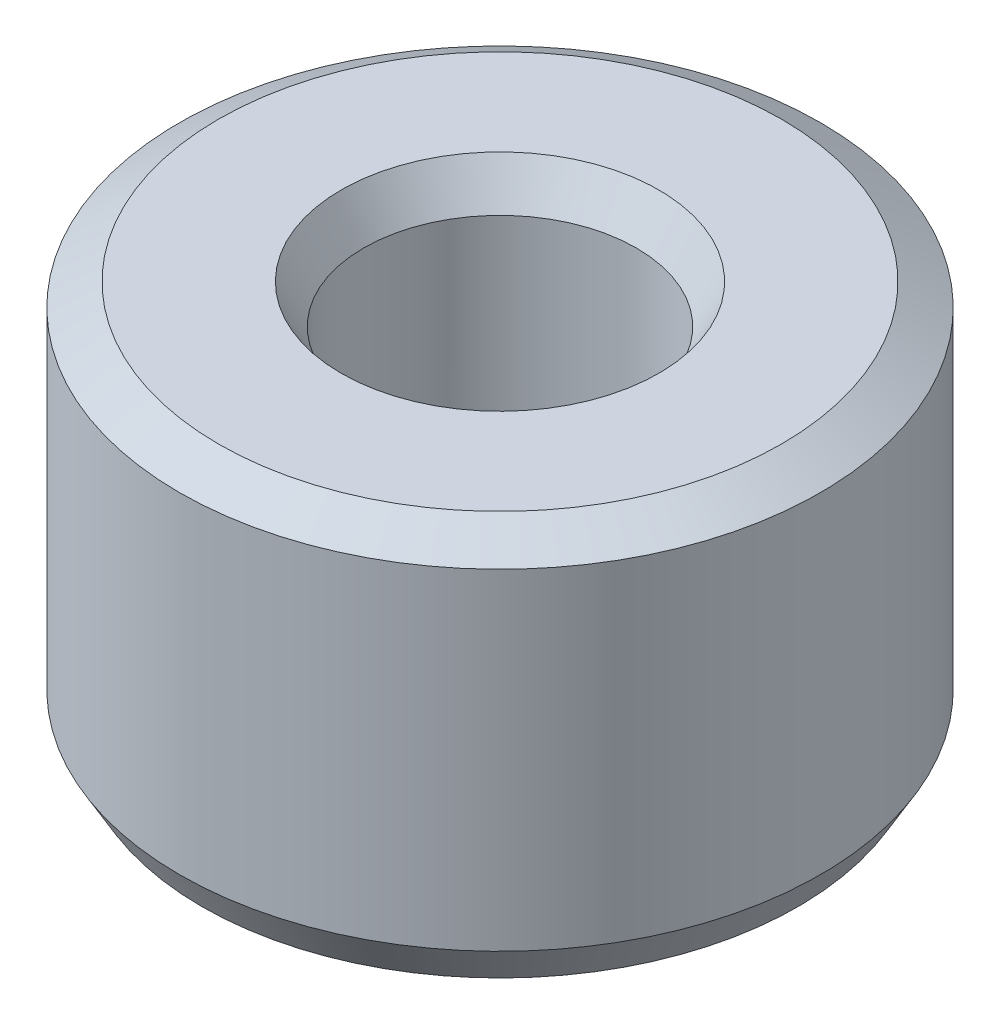
ISO-10303-21;
HEADER;
FILE_DESCRIPTION(('STEP AP214'),'2;1');
FILE_NAME('part.step','',(''),(''),'','','');
FILE_SCHEMA(('AUTOMOTIVE_DESIGN { 1 0 10303 214 1 1 1 1 }'));
ENDSEC;
DATA;
#1=APPLICATION_CONTEXT('core data for automotive mechanical design processes');
#2=APPLICATION_PROTOCOL_DEFINITION('international standard','automotive_design',2000,#1);
#3=PRODUCT_CONTEXT('',#1,'mechanical');
#4=PRODUCT('Part','Part','',(#3));
#5=PRODUCT_RELATED_PRODUCT_CATEGORY('part','',(#4));
#6=PRODUCT_DEFINITION_FORMATION('','',#4);
#7=PRODUCT_DEFINITION_CONTEXT('part definition',#1,'design');
#8=PRODUCT_DEFINITION('design','',#6,#7);
#9=PRODUCT_DEFINITION_SHAPE('','',#8);
#10=(LENGTH_UNIT() NAMED_UNIT(*) SI_UNIT(.MILLI.,.METRE.));
#11=(NAMED_UNIT(*) PLANE_ANGLE_UNIT() SI_UNIT($,.RADIAN.));
#12=(NAMED_UNIT(*) SI_UNIT($,.STERADIAN.) SOLID_ANGLE_UNIT());
#13=UNCERTAINTY_MEASURE_WITH_UNIT(LENGTH_MEASURE(1.E-05),#10,'distance_accuracy_value','');
#14=(GEOMETRIC_REPRESENTATION_CONTEXT(3) GLOBAL_UNCERTAINTY_ASSIGNED_CONTEXT((#13)) GLOBAL_UNIT_ASSIGNED_CONTEXT((#10,
#11,#12)) REPRESENTATION_CONTEXT('',''));
#15=CARTESIAN_POINT('',(0.,0.,0.));
#16=DIRECTION('',(0.,0.,1.));
#17=DIRECTION('',(1.,0.,0.));
#18=AXIS2_PLACEMENT_3D('',#15,#16,#17);
#19=CARTESIAN_POINT('',(0.,36.7362978633846,0.));
#20=DIRECTION('',(0.,-1.,0.));
#21=DIRECTION('',(0.,0.,-1.));
#22=AXIS2_PLACEMENT_3D('',#19,#20,#21);
#23=CYLINDRICAL_SURFACE('',#22,30.);
#24=CARTESIAN_POINT('',(0.,3.65282052858019,0.));
#25=DIRECTION('',(0.,1.,0.));
#26=DIRECTION('',(0.,0.,1.));
#27=AXIS2_PLACEMENT_3D('',#24,#25,#26);
#28=CIRCLE('',#27,30.);
#29=CARTESIAN_POINT('',(0.,3.65282052858018,-30.));
#30=VERTEX_POINT('',#29);
#31=EDGE_CURVE('E10',#30,#30,#28,.T.);
#32=CARTESIAN_POINT('',(0.,34.6273409479074,0.));
#33=DIRECTION('',(0.,1.,0.));
#34=DIRECTION('',(0.,0.,1.));
#35=AXIS2_PLACEMENT_3D('',#32,#33,#34);
#36=CIRCLE('',#35,30.);
#37=CARTESIAN_POINT('',(0.,34.6273409479074,-30.));
#38=VERTEX_POINT('',#37);
#39=EDGE_CURVE('E50',#38,#38,#36,.F.);
#40=CARTESIAN_POINT('',(0.,3.65282052858018,-30.));
#41=CARTESIAN_POINT('',(0.,3.97547178294817,-30.));
#42=CARTESIAN_POINT('',(0.,4.29812303731616,-30.));
#43=CARTESIAN_POINT('',(0.,4.94342554605215,-30.));
#44=CARTESIAN_POINT('',(0.,5.26607680042014,-30.));
#45=CARTESIAN_POINT('',(0.,5.91137930915612,-30.));
#46=CARTESIAN_POINT('',(0.,6.23403056352411,-30.));
#47=CARTESIAN_POINT('',(0.,6.8793330722601,-30.));
#48=CARTESIAN_POINT('',(0.,7.20198432662809,-30.));
#49=CARTESIAN_POINT('',(0.,7.84728683536408,-30.));
#50=CARTESIAN_POINT('',(0.,8.16993808973207,-30.));
#51=CARTESIAN_POINT('',(0.,8.81524059846805,-30.));
#52=CARTESIAN_POINT('',(0.,9.13789185283604,-30.));
#53=CARTESIAN_POINT('',(0.,9.78319436157203,-30.));
#54=CARTESIAN_POINT('',(0.,10.10584561594,-30.));
#55=CARTESIAN_POINT('',(0.,10.751148124676,-30.));
#56=CARTESIAN_POINT('',(0.,11.073799379044,-30.));
#57=CARTESIAN_POINT('',(0.,11.71910188778,-30.));
#58=CARTESIAN_POINT('',(0.,12.041753142148,-30.));
#59=CARTESIAN_POINT('',(0.,12.687055650884,-30.));
#60=CARTESIAN_POINT('',(0.,13.009706905252,-30.));
#61=CARTESIAN_POINT('',(0.,13.6550094139879,-30.));
#62=CARTESIAN_POINT('',(0.,13.9776606683559,-30.));
#63=CARTESIAN_POINT('',(0.,14.6229631770919,-30.));
#64=CARTESIAN_POINT('',(0.,14.9456144314599,-30.));
#65=CARTESIAN_POINT('',(0.,15.5909169401959,-30.));
#66=CARTESIAN_POINT('',(0.,15.9135681945639,-30.));
#67=CARTESIAN_POINT('',(0.,16.5588707032999,-30.));
#68=CARTESIAN_POINT('',(0.,16.8815219576679,-30.));
#69=CARTESIAN_POINT('',(0.,17.5268244664038,-30.));
#70=CARTESIAN_POINT('',(0.,17.8494757207718,-30.));
#71=CARTESIAN_POINT('',(0.,18.4947782295078,-30.));
#72=CARTESIAN_POINT('',(0.,18.8174294838758,-30.));
#73=CARTESIAN_POINT('',(0.,19.4627319926118,-30.));
#74=CARTESIAN_POINT('',(0.,19.7853832469798,-30.));
#75=CARTESIAN_POINT('',(0.,20.4306857557158,-30.));
#76=CARTESIAN_POINT('',(0.,20.7533370100838,-30.));
#77=CARTESIAN_POINT('',(0.,21.3986395188198,-30.));
#78=CARTESIAN_POINT('',(0.,21.7212907731877,-30.));
#79=CARTESIAN_POINT('',(0.,22.3665932819237,-30.));
#80=CARTESIAN_POINT('',(0.,22.6892445362917,-30.));
#81=CARTESIAN_POINT('',(0.,23.3345470450277,-30.));
#82=CARTESIAN_POINT('',(0.,23.6571982993957,-30.));
#83=CARTESIAN_POINT('',(0.,24.3025008081317,-30.));
#84=CARTESIAN_POINT('',(0.,24.6251520624997,-30.));
#85=CARTESIAN_POINT('',(0.,25.2704545712357,-30.));
#86=CARTESIAN_POINT('',(0.,25.5931058256036,-30.));
#87=CARTESIAN_POINT('',(0.,26.2384083343396,-30.));
#88=CARTESIAN_POINT('',(0.,26.5610595887076,-30.));
#89=CARTESIAN_POINT('',(0.,27.2063620974436,-30.));
#90=CARTESIAN_POINT('',(0.,27.5290133518116,-30.));
#91=CARTESIAN_POINT('',(0.,28.1743158605476,-30.));
#92=CARTESIAN_POINT('',(0.,28.4969671149156,-30.));
#93=CARTESIAN_POINT('',(0.,29.1422696236516,-30.));
#94=CARTESIAN_POINT('',(0.,29.4649208780196,-30.));
#95=CARTESIAN_POINT('',(0.,30.1102233867555,-30.));
#96=CARTESIAN_POINT('',(0.,30.4328746411235,-30.));
#97=CARTESIAN_POINT('',(0.,31.0781771498595,-30.));
#98=CARTESIAN_POINT('',(0.,31.4008284042275,-30.));
#99=CARTESIAN_POINT('',(0.,32.0461309129635,-30.));
#100=CARTESIAN_POINT('',(0.,32.3687821673315,-30.));
#101=CARTESIAN_POINT('',(0.,33.0140846760675,-30.));
#102=CARTESIAN_POINT('',(0.,33.3367359304355,-30.));
#103=CARTESIAN_POINT('',(0.,33.9820384391714,-30.));
#104=CARTESIAN_POINT('',(0.,34.3046896935394,-30.));
#105=CARTESIAN_POINT('',(0.,34.6273409479074,-30.));
#106=B_SPLINE_CURVE_WITH_KNOTS('',3,(#40,#41,#42,#43,#44,#45,#46,#47,#48,#49,#50,#51,#52,#53,
#54,#55,#56,#57,#58,#59,#60,#61,#62,#63,#64,#65,#66,#67,#68,#69,#70,#71,#72,#73,#74,#75,#76,#77,
#78,#79,#80,#81,#82,#83,#84,#85,#86,#87,#88,#89,#90,#91,#92,#93,#94,#95,#96,#97,#98,#99,#100,
#101,#102,#103,#104,#105),.UNSPECIFIED.,.F.,.F.,(4,2,2,2,2,2,2,2,2,2,2,2,2,2,2,2,2,2,2,2,2,2,2,
2,2,2,2,2,2,2,2,2,4),(0.,0.967953763103976,1.93590752620795,2.90386128931193,3.8718150524159,
4.83976881551988,5.80772257862385,6.77567634172784,7.74363010483181,8.71158386793579,
9.67953763103976,10.6474913941437,11.6154451572477,12.5833989203517,13.5513526834557,
14.5193064465596,15.4872602096636,16.4552139727676,17.4231677358716,18.3911214989756,
19.3590752620795,20.3270290251835,21.2949827882875,22.2629365513915,23.2308903144954,
24.1988440775994,25.1667978407034,26.1347516038074,27.1027053669113,28.0706591300153,
29.0386128931193,30.0065666562233,30.9745204193273),.UNSPECIFIED.);
#107=EDGE_CURVE('BSEAM39',#30,#38,#106,.T.);
#108=ORIENTED_EDGE('',*,*,#31,.T.);
#109=ORIENTED_EDGE('',*,*,#39,.T.);
#110=ORIENTED_EDGE('',*,*,#107,.T.);
#111=ORIENTED_EDGE('',*,*,#107,.F.);
#112=EDGE_LOOP('',(#108,#110,#109,#111));
#113=FACE_BOUND('',#112,.T.);
#114=ADVANCED_FACE('F39',(#113),#23,.T.);
#115=CARTESIAN_POINT('',(0.,36.7362978633846,0.));
#116=DIRECTION('',(0.,1.,0.));
#117=DIRECTION('',(0.,0.,1.));
#118=AXIS2_PLACEMENT_3D('',#115,#116,#117);
#119=PLANE('',#118);
#120=CARTESIAN_POINT('',(0.,36.7362978633846,0.));
#121=DIRECTION('',(0.,1.,0.));
#122=DIRECTION('',(0.,0.,1.));
#123=AXIS2_PLACEMENT_3D('',#120,#121,#122);
#124=CIRCLE('',#123,14.8705654255962);
#125=CARTESIAN_POINT('',(0.,36.7362978633846,14.8705654255962));
#126=VERTEX_POINT('',#125);
#127=EDGE_CURVE('E58',#126,#126,#124,.F.);
#128=ORIENTED_EDGE('',*,*,#127,.T.);
#129=EDGE_LOOP('',(#128));
#130=FACE_BOUND('',#129,.T.);
#131=CARTESIAN_POINT('',(0.,36.7362978633846,0.));
#132=DIRECTION('',(0.,1.,0.));
#133=DIRECTION('',(0.,0.,1.));
#134=AXIS2_PLACEMENT_3D('',#131,#132,#133);
#135=CIRCLE('',#134,26.3471794714199);
#136=CARTESIAN_POINT('',(0.,36.7362978633846,26.3471794714199));
#137=VERTEX_POINT('',#136);
#138=EDGE_CURVE('E61',#137,#137,#135,.T.);
#139=ORIENTED_EDGE('',*,*,#138,.T.);
#140=EDGE_LOOP('',(#139));
#141=FACE_BOUND('',#140,.T.);
#142=ADVANCED_FACE('F88',(#130,#141),#119,.T.);
#143=CARTESIAN_POINT('',(0.,0.,0.));
#144=DIRECTION('',(0.,1.,0.));
#145=DIRECTION('',(0.,0.,1.));
#146=AXIS2_PLACEMENT_3D('',#143,#144,#145);
#147=PLANE('',#146);
#148=CARTESIAN_POINT('',(0.,0.,0.));
#149=DIRECTION('',(0.,1.,0.));
#150=DIRECTION('',(0.,0.,1.));
#151=AXIS2_PLACEMENT_3D('',#148,#149,#150);
#152=CIRCLE('',#151,16.4144290386991);
#153=CARTESIAN_POINT('',(0.,0.,16.4144290386991));
#154=VERTEX_POINT('',#153);
#155=EDGE_CURVE('E51',#154,#154,#152,.T.);
#156=ORIENTED_EDGE('',*,*,#155,.T.);
#157=EDGE_LOOP('',(#156));
#158=FACE_BOUND('',#157,.T.);
#159=CARTESIAN_POINT('',(0.,0.,0.));
#160=DIRECTION('',(0.,1.,0.));
#161=DIRECTION('',(0.,0.,1.));
#162=AXIS2_PLACEMENT_3D('',#159,#160,#161);
#163=CIRCLE('',#162,27.8910430845228);
#164=CARTESIAN_POINT('',(0.,0.,27.8910430845228));
#165=VERTEX_POINT('',#164);
#166=EDGE_CURVE('E54',#165,#165,#163,.F.);
#167=ORIENTED_EDGE('',*,*,#166,.T.);
#168=EDGE_LOOP('',(#167));
#169=FACE_BOUND('',#168,.T.);
#170=ADVANCED_FACE('F83',(#158,#169),#147,.F.);
#171=CARTESIAN_POINT('',(0.,36.7362978633846,0.));
#172=DIRECTION('',(0.,-1.,0.));
#173=DIRECTION('',(0.,0.,-1.));
#174=AXIS2_PLACEMENT_3D('',#171,#172,#173);
#175=CYLINDRICAL_SURFACE('',#174,12.761608510119);
#176=CARTESIAN_POINT('',(0.,33.0834773348043,0.));
#177=DIRECTION('',(0.,1.,0.));
#178=DIRECTION('',(0.,0.,1.));
#179=AXIS2_PLACEMENT_3D('',#176,#177,#178);
#180=CIRCLE('',#179,12.761608510119);
#181=CARTESIAN_POINT('',(0.,33.0834773348043,-12.761608510119));
#182=VERTEX_POINT('',#181);
#183=EDGE_CURVE('E67',#182,#182,#180,.T.);
#184=CARTESIAN_POINT('',(0.,2.10895691547713,0.));
#185=DIRECTION('',(0.,1.,0.));
#186=DIRECTION('',(0.,0.,1.));
#187=AXIS2_PLACEMENT_3D('',#184,#185,#186);
#188=CIRCLE('',#187,12.761608510119);
#189=CARTESIAN_POINT('',(0.,2.10895691547712,-12.761608510119));
#190=VERTEX_POINT('',#189);
#191=EDGE_CURVE('E69',#190,#190,#188,.F.);
#192=CARTESIAN_POINT('',(0.,33.0834773348043,-12.761608510119));
#193=CARTESIAN_POINT('',(0.,32.7608260804364,-12.761608510119));
#194=CARTESIAN_POINT('',(0.,32.4381748260684,-12.761608510119));
#195=CARTESIAN_POINT('',(0.,31.7928723173324,-12.761608510119));
#196=CARTESIAN_POINT('',(0.,31.4702210629644,-12.761608510119));
#197=CARTESIAN_POINT('',(0.,30.8249185542284,-12.761608510119));
#198=CARTESIAN_POINT('',(0.,30.5022672998604,-12.761608510119));
#199=CARTESIAN_POINT('',(0.,29.8569647911244,-12.761608510119));
#200=CARTESIAN_POINT('',(0.,29.5343135367564,-12.761608510119));
#201=CARTESIAN_POINT('',(0.,28.8890110280204,-12.761608510119));
#202=CARTESIAN_POINT('',(0.,28.5663597736525,-12.761608510119));
#203=CARTESIAN_POINT('',(0.,27.9210572649165,-12.761608510119));
#204=CARTESIAN_POINT('',(0.,27.5984060105485,-12.761608510119));
#205=CARTESIAN_POINT('',(0.,26.9531035018125,-12.761608510119));
#206=CARTESIAN_POINT('',(0.,26.6304522474445,-12.761608510119));
#207=CARTESIAN_POINT('',(0.,25.9851497387085,-12.761608510119));
#208=CARTESIAN_POINT('',(0.,25.6624984843405,-12.761608510119));
#209=CARTESIAN_POINT('',(0.,25.0171959756045,-12.761608510119));
#210=CARTESIAN_POINT('',(0.,24.6945447212366,-12.761608510119));
#211=CARTESIAN_POINT('',(0.,24.0492422125006,-12.761608510119));
#212=CARTESIAN_POINT('',(0.,23.7265909581326,-12.761608510119));
#213=CARTESIAN_POINT('',(0.,23.0812884493966,-12.761608510119));
#214=CARTESIAN_POINT('',(0.,22.7586371950286,-12.761608510119));
#215=CARTESIAN_POINT('',(0.,22.1133346862926,-12.761608510119));
#216=CARTESIAN_POINT('',(0.,21.7906834319246,-12.761608510119));
#217=CARTESIAN_POINT('',(0.,21.1453809231886,-12.761608510119));
#218=CARTESIAN_POINT('',(0.,20.8227296688207,-12.761608510119));
#219=CARTESIAN_POINT('',(0.,20.1774271600847,-12.761608510119));
#220=CARTESIAN_POINT('',(0.,19.8547759057167,-12.761608510119));
#221=CARTESIAN_POINT('',(0.,19.2094733969807,-12.761608510119));
#222=CARTESIAN_POINT('',(0.,18.8868221426127,-12.761608510119));
#223=CARTESIAN_POINT('',(0.,18.2415196338767,-12.761608510119));
#224=CARTESIAN_POINT('',(0.,17.9188683795087,-12.761608510119));
#225=CARTESIAN_POINT('',(0.,17.2735658707727,-12.761608510119));
#226=CARTESIAN_POINT('',(0.,16.9509146164048,-12.761608510119));
#227=CARTESIAN_POINT('',(0.,16.3056121076688,-12.761608510119));
#228=CARTESIAN_POINT('',(0.,15.9829608533008,-12.761608510119));
#229=CARTESIAN_POINT('',(0.,15.3376583445648,-12.761608510119));
#230=CARTESIAN_POINT('',(0.,15.0150070901968,-12.761608510119));
#231=CARTESIAN_POINT('',(0.,14.3697045814608,-12.761608510119));
#232=CARTESIAN_POINT('',(0.,14.0470533270928,-12.761608510119));
#233=CARTESIAN_POINT('',(0.,13.4017508183568,-12.761608510119));
#234=CARTESIAN_POINT('',(0.,13.0790995639888,-12.761608510119));
#235=CARTESIAN_POINT('',(0.,12.4337970552529,-12.761608510119));
#236=CARTESIAN_POINT('',(0.,12.1111458008849,-12.761608510119));
#237=CARTESIAN_POINT('',(0.,11.4658432921489,-12.761608510119));
#238=CARTESIAN_POINT('',(0.,11.1431920377809,-12.761608510119));
#239=CARTESIAN_POINT('',(0.,10.4978895290449,-12.761608510119));
#240=CARTESIAN_POINT('',(0.,10.1752382746769,-12.761608510119));
#241=CARTESIAN_POINT('',(0.,9.52993576594093,-12.761608510119));
#242=CARTESIAN_POINT('',(0.,9.20728451157294,-12.761608510119));
#243=CARTESIAN_POINT('',(0.,8.56198200283696,-12.761608510119));
#244=CARTESIAN_POINT('',(0.,8.23933074846896,-12.761608510119));
#245=CARTESIAN_POINT('',(0.,7.59402823973298,-12.761608510119));
#246=CARTESIAN_POINT('',(0.,7.27137698536499,-12.761608510119));
#247=CARTESIAN_POINT('',(0.,6.62607447662901,-12.761608510119));
#248=CARTESIAN_POINT('',(0.,6.30342322226101,-12.761608510119));
#249=CARTESIAN_POINT('',(0.,5.65812071352503,-12.761608510119));
#250=CARTESIAN_POINT('',(0.,5.33546945915704,-12.761608510119));
#251=CARTESIAN_POINT('',(0.,4.69016695042106,-12.761608510119));
#252=CARTESIAN_POINT('',(0.,4.36751569605306,-12.761608510119));
#253=CARTESIAN_POINT('',(0.,3.72221318731708,-12.761608510119));
#254=CARTESIAN_POINT('',(0.,3.39956193294909,-12.761608510119));
#255=CARTESIAN_POINT('',(0.,2.7542594242131,-12.761608510119));
#256=CARTESIAN_POINT('',(0.,2.43160816984511,-12.761608510119));
#257=CARTESIAN_POINT('',(0.,2.10895691547712,-12.761608510119));
#258=B_SPLINE_CURVE_WITH_KNOTS('',3,(#192,#193,#194,#195,#196,#197,#198,#199,#200,#201,#202,
#203,#204,#205,#206,#207,#208,#209,#210,#211,#212,#213,#214,#215,#216,#217,#218,#219,#220,#221,
#222,#223,#224,#225,#226,#227,#228,#229,#230,#231,#232,#233,#234,#235,#236,#237,#238,#239,#240,
#241,#242,#243,#244,#245,#246,#247,#248,#249,#250,#251,#252,#253,#254,#255,#256,#257),
.UNSPECIFIED.,.F.,.F.,(4,2,2,2,2,2,2,2,2,2,2,2,2,2,2,2,2,2,2,2,2,2,2,2,2,2,2,2,2,2,2,2,4),(0.,
0.967953763103969,1.93590752620795,2.90386128931193,3.8718150524159,4.83976881551988,
5.80772257862385,6.77567634172783,7.7436301048318,8.71158386793578,9.67953763103976,
10.6474913941437,11.6154451572477,12.5833989203517,13.5513526834557,14.5193064465596,
15.4872602096636,16.4552139727676,17.4231677358716,18.3911214989755,19.3590752620795,
20.3270290251835,21.2949827882875,22.2629365513914,23.2308903144954,24.1988440775994,
25.1667978407034,26.1347516038073,27.1027053669113,28.0706591300153,29.0386128931193,
30.0065666562232,30.9745204193272),.UNSPECIFIED.);
#259=EDGE_CURVE('BSEAM71',#182,#190,#258,.T.);
#260=ORIENTED_EDGE('',*,*,#183,.T.);
#261=ORIENTED_EDGE('',*,*,#191,.T.);
#262=ORIENTED_EDGE('',*,*,#259,.T.);
#263=ORIENTED_EDGE('',*,*,#259,.F.);
#264=EDGE_LOOP('',(#260,#262,#261,#263));
#265=FACE_BOUND('',#264,.T.);
#266=ADVANCED_FACE('F71',(#265),#175,.F.);
#267=CARTESIAN_POINT('',(0.,33.0834773348043,0.));
#268=DIRECTION('',(0.,1.,0.));
#269=DIRECTION('',(0.,0.,1.));
#270=AXIS2_PLACEMENT_3D('',#267,#268,#269);
#271=CONICAL_SURFACE('',#270,12.761608510119,0.523598775598303);
#272=ORIENTED_EDGE('',*,*,#127,.F.);
#273=EDGE_LOOP('',(#272));
#274=FACE_BOUND('',#273,.T.);
#275=ORIENTED_EDGE('',*,*,#183,.F.);
#276=EDGE_LOOP('',(#275));
#277=FACE_BOUND('',#276,.T.);
#278=ADVANCED_FACE('F77',(#274,#277),#271,.F.);
#279=CARTESIAN_POINT('',(0.,0.,0.));
#280=DIRECTION('',(0.,-1.,0.));
#281=DIRECTION('',(0.,0.,-1.));
#282=AXIS2_PLACEMENT_3D('',#279,#280,#281);
#283=CONICAL_SURFACE('',#282,16.4144290386991,1.0471975511966);
#284=ORIENTED_EDGE('',*,*,#191,.F.);
#285=EDGE_LOOP('',(#284));
#286=FACE_BOUND('',#285,.T.);
#287=ORIENTED_EDGE('',*,*,#155,.F.);
#288=EDGE_LOOP('',(#287));
#289=FACE_BOUND('',#288,.T.);
#290=ADVANCED_FACE('F73',(#286,#289),#283,.F.);
#291=CARTESIAN_POINT('',(0.,3.65282052858018,0.));
#292=DIRECTION('',(0.,1.,0.));
#293=DIRECTION('',(0.,0.,1.));
#294=AXIS2_PLACEMENT_3D('',#291,#292,#293);
#295=CONICAL_SURFACE('',#294,30.,0.523598775598304);
#296=ORIENTED_EDGE('',*,*,#166,.F.);
#297=EDGE_LOOP('',(#296));
#298=FACE_BOUND('',#297,.T.);
#299=ORIENTED_EDGE('',*,*,#31,.F.);
#300=EDGE_LOOP('',(#299));
#301=FACE_BOUND('',#300,.T.);
#302=ADVANCED_FACE('F76',(#298,#301),#295,.T.);
#303=CARTESIAN_POINT('',(0.,36.7362978633846,0.));
#304=DIRECTION('',(0.,-1.,0.));
#305=DIRECTION('',(0.,0.,-1.));
#306=AXIS2_PLACEMENT_3D('',#303,#304,#305);
#307=CONICAL_SURFACE('',#306,26.3471794714199,1.04719755119659);
#308=ORIENTED_EDGE('',*,*,#39,.F.);
#309=EDGE_LOOP('',(#308));
#310=FACE_BOUND('',#309,.T.);
#311=ORIENTED_EDGE('',*,*,#138,.F.);
#312=EDGE_LOOP('',(#311));
#313=FACE_BOUND('',#312,.T.);
#314=ADVANCED_FACE('F45',(#310,#313),#307,.T.);
#315=CLOSED_SHELL('',(#114,#142,#170,#266,#278,#290,#302,#314));
#316=MANIFOLD_SOLID_BREP('B2',#315);
#317=ADVANCED_BREP_SHAPE_REPRESENTATION('',(#18,#316),#14);
#318=SHAPE_DEFINITION_REPRESENTATION(#9,#317);
ENDSEC;
END-ISO-10303-21;
